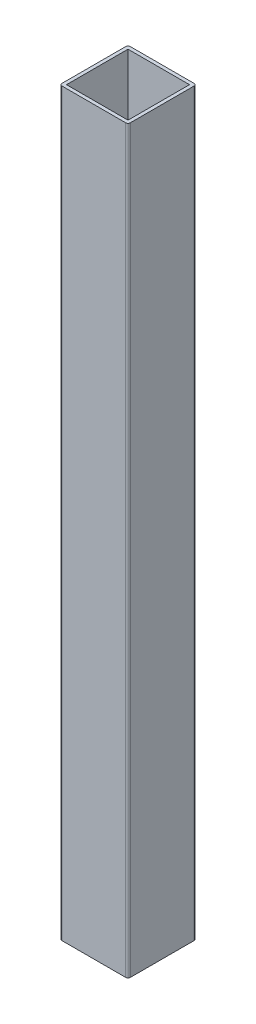
ISO-10303-21;
HEADER;
FILE_DESCRIPTION(('STEP AP214'),'2;1');
FILE_NAME('part.step','',(''),(''),'','','');
FILE_SCHEMA(('AUTOMOTIVE_DESIGN { 1 0 10303 214 1 1 1 1 }'));
ENDSEC;
DATA;
#1=APPLICATION_CONTEXT('core data for automotive mechanical design processes');
#2=APPLICATION_PROTOCOL_DEFINITION('international standard','automotive_design',2000,#1);
#3=PRODUCT_CONTEXT('',#1,'mechanical');
#4=PRODUCT('Part','Part','',(#3));
#5=PRODUCT_RELATED_PRODUCT_CATEGORY('part','',(#4));
#6=PRODUCT_DEFINITION_FORMATION('','',#4);
#7=PRODUCT_DEFINITION_CONTEXT('part definition',#1,'design');
#8=PRODUCT_DEFINITION('design','',#6,#7);
#9=PRODUCT_DEFINITION_SHAPE('','',#8);
#10=(LENGTH_UNIT() NAMED_UNIT(*) SI_UNIT(.MILLI.,.METRE.));
#11=(NAMED_UNIT(*) PLANE_ANGLE_UNIT() SI_UNIT($,.RADIAN.));
#12=(NAMED_UNIT(*) SI_UNIT($,.STERADIAN.) SOLID_ANGLE_UNIT());
#13=UNCERTAINTY_MEASURE_WITH_UNIT(LENGTH_MEASURE(1.E-05),#10,'distance_accuracy_value','');
#14=(GEOMETRIC_REPRESENTATION_CONTEXT(3) GLOBAL_UNCERTAINTY_ASSIGNED_CONTEXT((#13)) GLOBAL_UNIT_ASSIGNED_CONTEXT((#10,
#11,#12)) REPRESENTATION_CONTEXT('',''));
#15=CARTESIAN_POINT('',(0.,0.,0.));
#16=DIRECTION('',(0.,0.,1.));
#17=DIRECTION('',(1.,0.,0.));
#18=AXIS2_PLACEMENT_3D('',#15,#16,#17);
#19=CARTESIAN_POINT('',(58.,650.,-58.));
#20=DIRECTION('',(0.,-1.,0.));
#21=DIRECTION('',(0.,0.,-1.));
#22=AXIS2_PLACEMENT_3D('',#19,#20,#21);
#23=PLANE('',#22);
#24=CARTESIAN_POINT('',(58.,650.,-58.));
#25=DIRECTION('',(0.,1.,0.));
#26=DIRECTION('',(0.,0.,-1.));
#27=AXIS2_PLACEMENT_3D('',#24,#25,#26);
#28=CIRCLE('',#27,2.);
#29=CARTESIAN_POINT('',(60.,650.,-58.));
#30=VERTEX_POINT('',#29);
#31=CARTESIAN_POINT('',(58.,650.,-60.));
#32=VERTEX_POINT('',#31);
#33=EDGE_CURVE('E159',#30,#32,#28,.T.);
#34=ORIENTED_EDGE('',*,*,#33,.T.);
#35=DIRECTION('',(-1.,0.,0.));
#36=VECTOR('',#35,1.);
#37=CARTESIAN_POINT('',(2.00000000000001,650.,-60.));
#38=LINE('',#37,#36);
#39=CARTESIAN_POINT('',(2.00000000000001,650.,-60.));
#40=VERTEX_POINT('',#39);
#41=EDGE_CURVE('E162',#32,#40,#38,.T.);
#42=ORIENTED_EDGE('',*,*,#41,.T.);
#43=CARTESIAN_POINT('',(2.,650.,-58.));
#44=DIRECTION('',(0.,1.,0.));
#45=DIRECTION('',(0.,0.,-1.));
#46=AXIS2_PLACEMENT_3D('',#43,#44,#45);
#47=CIRCLE('',#46,2.);
#48=CARTESIAN_POINT('',(0.,650.,-58.));
#49=VERTEX_POINT('',#48);
#50=EDGE_CURVE('E165',#40,#49,#47,.T.);
#51=ORIENTED_EDGE('',*,*,#50,.T.);
#52=DIRECTION('',(0.,0.,1.));
#53=VECTOR('',#52,1.);
#54=CARTESIAN_POINT('',(0.,650.,-2.00000000000001));
#55=LINE('',#54,#53);
#56=CARTESIAN_POINT('',(0.,650.,-2.00000000000001));
#57=VERTEX_POINT('',#56);
#58=EDGE_CURVE('E167',#49,#57,#55,.T.);
#59=ORIENTED_EDGE('',*,*,#58,.T.);
#60=CARTESIAN_POINT('',(2.,650.,-2.));
#61=DIRECTION('',(0.,1.,0.));
#62=DIRECTION('',(0.,0.,-1.));
#63=AXIS2_PLACEMENT_3D('',#60,#61,#62);
#64=CIRCLE('',#63,2.);
#65=CARTESIAN_POINT('',(2.00000000000001,650.,0.));
#66=VERTEX_POINT('',#65);
#67=EDGE_CURVE('E169',#57,#66,#64,.T.);
#68=ORIENTED_EDGE('',*,*,#67,.T.);
#69=DIRECTION('',(1.,0.,0.));
#70=VECTOR('',#69,1.);
#71=CARTESIAN_POINT('',(2.00000000000001,650.,0.));
#72=LINE('',#71,#70);
#73=CARTESIAN_POINT('',(58.,650.,0.));
#74=VERTEX_POINT('',#73);
#75=EDGE_CURVE('E171',#66,#74,#72,.T.);
#76=ORIENTED_EDGE('',*,*,#75,.T.);
#77=CARTESIAN_POINT('',(58.,650.,-2.));
#78=DIRECTION('',(0.,1.,0.));
#79=DIRECTION('',(0.,0.,1.));
#80=AXIS2_PLACEMENT_3D('',#77,#78,#79);
#81=CIRCLE('',#80,2.);
#82=CARTESIAN_POINT('',(60.,650.,-2.));
#83=VERTEX_POINT('',#82);
#84=EDGE_CURVE('E173',#74,#83,#81,.T.);
#85=ORIENTED_EDGE('',*,*,#84,.T.);
#86=DIRECTION('',(0.,0.,-1.));
#87=VECTOR('',#86,1.);
#88=CARTESIAN_POINT('',(60.,650.,-2.));
#89=LINE('',#88,#87);
#90=EDGE_CURVE('E175',#83,#30,#89,.T.);
#91=ORIENTED_EDGE('',*,*,#90,.T.);
#92=EDGE_LOOP('',(#34,#42,#51,#59,#68,#76,#85,#91));
#93=FACE_BOUND('',#92,.T.);
#94=DIRECTION('',(0.,0.,1.));
#95=VECTOR('',#94,1.);
#96=CARTESIAN_POINT('',(3.,650.,-3.));
#97=LINE('',#96,#95);
#98=CARTESIAN_POINT('',(3.,650.,-57.));
#99=VERTEX_POINT('',#98);
#100=CARTESIAN_POINT('',(3.,650.,-3.));
#101=VERTEX_POINT('',#100);
#102=EDGE_CURVE('E123',#99,#101,#97,.T.);
#103=ORIENTED_EDGE('',*,*,#102,.F.);
#104=DIRECTION('',(-1.,0.,0.));
#105=VECTOR('',#104,1.);
#106=CARTESIAN_POINT('',(3.,650.,-57.));
#107=LINE('',#106,#105);
#108=CARTESIAN_POINT('',(57.,650.,-57.));
#109=VERTEX_POINT('',#108);
#110=EDGE_CURVE('E145',#109,#99,#107,.T.);
#111=ORIENTED_EDGE('',*,*,#110,.F.);
#112=DIRECTION('',(0.,0.,-1.));
#113=VECTOR('',#112,1.);
#114=CARTESIAN_POINT('',(57.,650.,-3.));
#115=LINE('',#114,#113);
#116=CARTESIAN_POINT('',(57.,650.,-3.));
#117=VERTEX_POINT('',#116);
#118=EDGE_CURVE('E143',#117,#109,#115,.T.);
#119=ORIENTED_EDGE('',*,*,#118,.F.);
#120=DIRECTION('',(1.,0.,0.));
#121=VECTOR('',#120,1.);
#122=CARTESIAN_POINT('',(3.,650.,-3.));
#123=LINE('',#122,#121);
#124=EDGE_CURVE('E131',#101,#117,#123,.T.);
#125=ORIENTED_EDGE('',*,*,#124,.F.);
#126=EDGE_LOOP('',(#103,#111,#119,#125));
#127=FACE_BOUND('',#126,.T.);
#128=ADVANCED_FACE('F34',(#93,#127),#23,.F.);
#129=CARTESIAN_POINT('',(58.,0.,-58.));
#130=DIRECTION('',(0.,-1.,0.));
#131=DIRECTION('',(0.,0.,-1.));
#132=AXIS2_PLACEMENT_3D('',#129,#130,#131);
#133=PLANE('',#132);
#134=CARTESIAN_POINT('',(58.,0.,-58.));
#135=DIRECTION('',(0.,1.,0.));
#136=DIRECTION('',(0.,0.,-1.));
#137=AXIS2_PLACEMENT_3D('',#134,#135,#136);
#138=CIRCLE('',#137,2.);
#139=CARTESIAN_POINT('',(60.,0.,-58.));
#140=VERTEX_POINT('',#139);
#141=CARTESIAN_POINT('',(58.,0.,-60.));
#142=VERTEX_POINT('',#141);
#143=EDGE_CURVE('E139',#140,#142,#138,.T.);
#144=ORIENTED_EDGE('',*,*,#143,.F.);
#145=DIRECTION('',(0.,0.,-1.));
#146=VECTOR('',#145,1.);
#147=CARTESIAN_POINT('',(60.,0.,-2.));
#148=LINE('',#147,#146);
#149=CARTESIAN_POINT('',(60.,0.,-2.));
#150=VERTEX_POINT('',#149);
#151=EDGE_CURVE('E163',#150,#140,#148,.T.);
#152=ORIENTED_EDGE('',*,*,#151,.F.);
#153=CARTESIAN_POINT('',(58.,0.,-2.));
#154=DIRECTION('',(0.,1.,0.));
#155=DIRECTION('',(0.,0.,1.));
#156=AXIS2_PLACEMENT_3D('',#153,#154,#155);
#157=CIRCLE('',#156,2.);
#158=CARTESIAN_POINT('',(58.,0.,0.));
#159=VERTEX_POINT('',#158);
#160=EDGE_CURVE('E190',#159,#150,#157,.T.);
#161=ORIENTED_EDGE('',*,*,#160,.F.);
#162=DIRECTION('',(1.,0.,0.));
#163=VECTOR('',#162,1.);
#164=CARTESIAN_POINT('',(2.00000000000001,0.,0.));
#165=LINE('',#164,#163);
#166=CARTESIAN_POINT('',(2.00000000000001,0.,0.));
#167=VERTEX_POINT('',#166);
#168=EDGE_CURVE('E188',#167,#159,#165,.T.);
#169=ORIENTED_EDGE('',*,*,#168,.F.);
#170=CARTESIAN_POINT('',(2.,0.,-2.));
#171=DIRECTION('',(0.,1.,0.));
#172=DIRECTION('',(0.,0.,-1.));
#173=AXIS2_PLACEMENT_3D('',#170,#171,#172);
#174=CIRCLE('',#173,2.);
#175=CARTESIAN_POINT('',(0.,0.,-2.00000000000001));
#176=VERTEX_POINT('',#175);
#177=EDGE_CURVE('E186',#176,#167,#174,.T.);
#178=ORIENTED_EDGE('',*,*,#177,.F.);
#179=DIRECTION('',(0.,0.,1.));
#180=VECTOR('',#179,1.);
#181=CARTESIAN_POINT('',(0.,0.,-2.00000000000001));
#182=LINE('',#181,#180);
#183=CARTESIAN_POINT('',(0.,0.,-58.));
#184=VERTEX_POINT('',#183);
#185=EDGE_CURVE('E184',#184,#176,#182,.T.);
#186=ORIENTED_EDGE('',*,*,#185,.F.);
#187=CARTESIAN_POINT('',(2.,0.,-58.));
#188=DIRECTION('',(0.,1.,0.));
#189=DIRECTION('',(0.,0.,-1.));
#190=AXIS2_PLACEMENT_3D('',#187,#188,#189);
#191=CIRCLE('',#190,2.);
#192=CARTESIAN_POINT('',(2.00000000000001,0.,-60.));
#193=VERTEX_POINT('',#192);
#194=EDGE_CURVE('E182',#193,#184,#191,.T.);
#195=ORIENTED_EDGE('',*,*,#194,.F.);
#196=DIRECTION('',(-1.,0.,0.));
#197=VECTOR('',#196,1.);
#198=CARTESIAN_POINT('',(2.00000000000001,0.,-60.));
#199=LINE('',#198,#197);
#200=EDGE_CURVE('E180',#142,#193,#199,.T.);
#201=ORIENTED_EDGE('',*,*,#200,.F.);
#202=EDGE_LOOP('',(#144,#152,#161,#169,#178,#186,#195,#201));
#203=FACE_BOUND('',#202,.T.);
#204=DIRECTION('',(-1.,0.,0.));
#205=VECTOR('',#204,1.);
#206=CARTESIAN_POINT('',(3.,0.,-57.));
#207=LINE('',#206,#205);
#208=CARTESIAN_POINT('',(57.,0.,-57.));
#209=VERTEX_POINT('',#208);
#210=CARTESIAN_POINT('',(3.,0.,-57.));
#211=VERTEX_POINT('',#210);
#212=EDGE_CURVE('E132',#209,#211,#207,.T.);
#213=ORIENTED_EDGE('',*,*,#212,.T.);
#214=DIRECTION('',(0.,0.,1.));
#215=VECTOR('',#214,1.);
#216=CARTESIAN_POINT('',(3.,0.,-3.));
#217=LINE('',#216,#215);
#218=CARTESIAN_POINT('',(3.,0.,-3.));
#219=VERTEX_POINT('',#218);
#220=EDGE_CURVE('E57',#211,#219,#217,.T.);
#221=ORIENTED_EDGE('',*,*,#220,.T.);
#222=DIRECTION('',(1.,0.,0.));
#223=VECTOR('',#222,1.);
#224=CARTESIAN_POINT('',(3.,0.,-3.));
#225=LINE('',#224,#223);
#226=CARTESIAN_POINT('',(57.,0.,-3.));
#227=VERTEX_POINT('',#226);
#228=EDGE_CURVE('E138',#219,#227,#225,.T.);
#229=ORIENTED_EDGE('',*,*,#228,.T.);
#230=DIRECTION('',(0.,0.,-1.));
#231=VECTOR('',#230,1.);
#232=CARTESIAN_POINT('',(57.,0.,-3.));
#233=LINE('',#232,#231);
#234=EDGE_CURVE('E151',#227,#209,#233,.T.);
#235=ORIENTED_EDGE('',*,*,#234,.T.);
#236=EDGE_LOOP('',(#213,#221,#229,#235));
#237=FACE_BOUND('',#236,.T.);
#238=ADVANCED_FACE('F220',(#203,#237),#133,.T.);
#239=CARTESIAN_POINT('',(58.,650.,-58.));
#240=DIRECTION('',(0.,-1.,0.));
#241=DIRECTION('',(0.,0.,-1.));
#242=AXIS2_PLACEMENT_3D('',#239,#240,#241);
#243=CYLINDRICAL_SURFACE('',#242,2.);
#244=ORIENTED_EDGE('',*,*,#143,.T.);
#245=DIRECTION('',(0.,-1.,0.));
#246=VECTOR('',#245,1.);
#247=CARTESIAN_POINT('',(58.,650.,-60.));
#248=LINE('',#247,#246);
#249=EDGE_CURVE('E11',#32,#142,#248,.T.);
#250=ORIENTED_EDGE('',*,*,#249,.F.);
#251=ORIENTED_EDGE('',*,*,#33,.F.);
#252=DIRECTION('',(0.,-1.,0.));
#253=VECTOR('',#252,1.);
#254=CARTESIAN_POINT('',(60.,650.,-58.));
#255=LINE('',#254,#253);
#256=EDGE_CURVE('E177',#30,#140,#255,.T.);
#257=ORIENTED_EDGE('',*,*,#256,.T.);
#258=EDGE_LOOP('',(#244,#250,#251,#257));
#259=FACE_BOUND('',#258,.T.);
#260=ADVANCED_FACE('F36',(#259),#243,.T.);
#261=CARTESIAN_POINT('',(2.00000000000001,650.,-60.));
#262=DIRECTION('',(0.,0.,1.));
#263=DIRECTION('',(1.,0.,0.));
#264=AXIS2_PLACEMENT_3D('',#261,#262,#263);
#265=PLANE('',#264);
#266=ORIENTED_EDGE('',*,*,#200,.T.);
#267=DIRECTION('',(0.,-1.,0.));
#268=VECTOR('',#267,1.);
#269=CARTESIAN_POINT('',(2.00000000000001,650.,-60.));
#270=LINE('',#269,#268);
#271=EDGE_CURVE('E42',#40,#193,#270,.T.);
#272=ORIENTED_EDGE('',*,*,#271,.F.);
#273=ORIENTED_EDGE('',*,*,#41,.F.);
#274=ORIENTED_EDGE('',*,*,#249,.T.);
#275=EDGE_LOOP('',(#266,#272,#273,#274));
#276=FACE_BOUND('',#275,.T.);
#277=ADVANCED_FACE('F237',(#276),#265,.F.);
#278=CARTESIAN_POINT('',(2.,650.,-58.));
#279=DIRECTION('',(0.,-1.,0.));
#280=DIRECTION('',(0.,0.,-1.));
#281=AXIS2_PLACEMENT_3D('',#278,#279,#280);
#282=CYLINDRICAL_SURFACE('',#281,2.);
#283=ORIENTED_EDGE('',*,*,#194,.T.);
#284=DIRECTION('',(0.,-1.,0.));
#285=VECTOR('',#284,1.);
#286=CARTESIAN_POINT('',(0.,650.,-58.));
#287=LINE('',#286,#285);
#288=EDGE_CURVE('E207',#49,#184,#287,.T.);
#289=ORIENTED_EDGE('',*,*,#288,.F.);
#290=ORIENTED_EDGE('',*,*,#50,.F.);
#291=ORIENTED_EDGE('',*,*,#271,.T.);
#292=EDGE_LOOP('',(#283,#289,#290,#291));
#293=FACE_BOUND('',#292,.T.);
#294=ADVANCED_FACE('F214',(#293),#282,.T.);
#295=CARTESIAN_POINT('',(0.,650.,-2.00000000000001));
#296=DIRECTION('',(1.,0.,0.));
#297=DIRECTION('',(0.,0.,-1.));
#298=AXIS2_PLACEMENT_3D('',#295,#296,#297);
#299=PLANE('',#298);
#300=ORIENTED_EDGE('',*,*,#185,.T.);
#301=DIRECTION('',(0.,-1.,0.));
#302=VECTOR('',#301,1.);
#303=CARTESIAN_POINT('',(0.,650.,-2.00000000000001));
#304=LINE('',#303,#302);
#305=EDGE_CURVE('E204',#57,#176,#304,.T.);
#306=ORIENTED_EDGE('',*,*,#305,.F.);
#307=ORIENTED_EDGE('',*,*,#58,.F.);
#308=ORIENTED_EDGE('',*,*,#288,.T.);
#309=EDGE_LOOP('',(#300,#306,#307,#308));
#310=FACE_BOUND('',#309,.T.);
#311=ADVANCED_FACE('F226',(#310),#299,.F.);
#312=CARTESIAN_POINT('',(2.,650.,-2.));
#313=DIRECTION('',(0.,-1.,0.));
#314=DIRECTION('',(0.,0.,-1.));
#315=AXIS2_PLACEMENT_3D('',#312,#313,#314);
#316=CYLINDRICAL_SURFACE('',#315,2.);
#317=ORIENTED_EDGE('',*,*,#177,.T.);
#318=DIRECTION('',(0.,-1.,0.));
#319=VECTOR('',#318,1.);
#320=CARTESIAN_POINT('',(2.00000000000001,650.,0.));
#321=LINE('',#320,#319);
#322=EDGE_CURVE('E201',#66,#167,#321,.T.);
#323=ORIENTED_EDGE('',*,*,#322,.F.);
#324=ORIENTED_EDGE('',*,*,#67,.F.);
#325=ORIENTED_EDGE('',*,*,#305,.T.);
#326=EDGE_LOOP('',(#317,#323,#324,#325));
#327=FACE_BOUND('',#326,.T.);
#328=ADVANCED_FACE('F230',(#327),#316,.T.);
#329=CARTESIAN_POINT('',(2.00000000000001,650.,0.));
#330=DIRECTION('',(0.,0.,-1.));
#331=DIRECTION('',(-1.,0.,0.));
#332=AXIS2_PLACEMENT_3D('',#329,#330,#331);
#333=PLANE('',#332);
#334=ORIENTED_EDGE('',*,*,#168,.T.);
#335=DIRECTION('',(0.,-1.,0.));
#336=VECTOR('',#335,1.);
#337=CARTESIAN_POINT('',(58.,650.,0.));
#338=LINE('',#337,#336);
#339=EDGE_CURVE('E198',#74,#159,#338,.T.);
#340=ORIENTED_EDGE('',*,*,#339,.F.);
#341=ORIENTED_EDGE('',*,*,#75,.F.);
#342=ORIENTED_EDGE('',*,*,#322,.T.);
#343=EDGE_LOOP('',(#334,#340,#341,#342));
#344=FACE_BOUND('',#343,.T.);
#345=ADVANCED_FACE('F250',(#344),#333,.F.);
#346=CARTESIAN_POINT('',(58.,650.,-2.));
#347=DIRECTION('',(0.,-1.,0.));
#348=DIRECTION('',(0.,0.,-1.));
#349=AXIS2_PLACEMENT_3D('',#346,#347,#348);
#350=CYLINDRICAL_SURFACE('',#349,2.);
#351=ORIENTED_EDGE('',*,*,#160,.T.);
#352=DIRECTION('',(0.,-1.,0.));
#353=VECTOR('',#352,1.);
#354=CARTESIAN_POINT('',(60.,650.,-2.));
#355=LINE('',#354,#353);
#356=EDGE_CURVE('E195',#83,#150,#355,.T.);
#357=ORIENTED_EDGE('',*,*,#356,.F.);
#358=ORIENTED_EDGE('',*,*,#84,.F.);
#359=ORIENTED_EDGE('',*,*,#339,.T.);
#360=EDGE_LOOP('',(#351,#357,#358,#359));
#361=FACE_BOUND('',#360,.T.);
#362=ADVANCED_FACE('F248',(#361),#350,.T.);
#363=CARTESIAN_POINT('',(60.,650.,-2.));
#364=DIRECTION('',(-1.,0.,0.));
#365=DIRECTION('',(0.,0.,1.));
#366=AXIS2_PLACEMENT_3D('',#363,#364,#365);
#367=PLANE('',#366);
#368=ORIENTED_EDGE('',*,*,#151,.T.);
#369=ORIENTED_EDGE('',*,*,#256,.F.);
#370=ORIENTED_EDGE('',*,*,#90,.F.);
#371=ORIENTED_EDGE('',*,*,#356,.T.);
#372=EDGE_LOOP('',(#368,#369,#370,#371));
#373=FACE_BOUND('',#372,.T.);
#374=ADVANCED_FACE('F243',(#373),#367,.F.);
#375=CARTESIAN_POINT('',(3.,650.,-3.));
#376=DIRECTION('',(1.,0.,0.));
#377=DIRECTION('',(0.,0.,-1.));
#378=AXIS2_PLACEMENT_3D('',#375,#376,#377);
#379=PLANE('',#378);
#380=ORIENTED_EDGE('',*,*,#220,.F.);
#381=DIRECTION('',(0.,-1.,0.));
#382=VECTOR('',#381,1.);
#383=CARTESIAN_POINT('',(3.,650.,-57.));
#384=LINE('',#383,#382);
#385=EDGE_CURVE('E127',#99,#211,#384,.T.);
#386=ORIENTED_EDGE('',*,*,#385,.F.);
#387=ORIENTED_EDGE('',*,*,#102,.T.);
#388=DIRECTION('',(0.,-1.,0.));
#389=VECTOR('',#388,1.);
#390=CARTESIAN_POINT('',(3.,650.,-3.));
#391=LINE('',#390,#389);
#392=EDGE_CURVE('E126',#101,#219,#391,.T.);
#393=ORIENTED_EDGE('',*,*,#392,.T.);
#394=EDGE_LOOP('',(#380,#386,#387,#393));
#395=FACE_BOUND('',#394,.T.);
#396=ADVANCED_FACE('F125',(#395),#379,.T.);
#397=CARTESIAN_POINT('',(3.,650.,-3.));
#398=DIRECTION('',(0.,0.,-1.));
#399=DIRECTION('',(-1.,0.,0.));
#400=AXIS2_PLACEMENT_3D('',#397,#398,#399);
#401=PLANE('',#400);
#402=ORIENTED_EDGE('',*,*,#228,.F.);
#403=ORIENTED_EDGE('',*,*,#392,.F.);
#404=ORIENTED_EDGE('',*,*,#124,.T.);
#405=DIRECTION('',(0.,-1.,0.));
#406=VECTOR('',#405,1.);
#407=CARTESIAN_POINT('',(57.,650.,-3.));
#408=LINE('',#407,#406);
#409=EDGE_CURVE('E140',#117,#227,#408,.T.);
#410=ORIENTED_EDGE('',*,*,#409,.T.);
#411=EDGE_LOOP('',(#402,#403,#404,#410));
#412=FACE_BOUND('',#411,.T.);
#413=ADVANCED_FACE('F135',(#412),#401,.T.);
#414=CARTESIAN_POINT('',(57.,650.,-3.));
#415=DIRECTION('',(-1.,0.,0.));
#416=DIRECTION('',(0.,0.,1.));
#417=AXIS2_PLACEMENT_3D('',#414,#415,#416);
#418=PLANE('',#417);
#419=ORIENTED_EDGE('',*,*,#234,.F.);
#420=ORIENTED_EDGE('',*,*,#409,.F.);
#421=ORIENTED_EDGE('',*,*,#118,.T.);
#422=DIRECTION('',(0.,-1.,0.));
#423=VECTOR('',#422,1.);
#424=CARTESIAN_POINT('',(57.,650.,-57.));
#425=LINE('',#424,#423);
#426=EDGE_CURVE('E49',#109,#209,#425,.T.);
#427=ORIENTED_EDGE('',*,*,#426,.T.);
#428=EDGE_LOOP('',(#419,#420,#421,#427));
#429=FACE_BOUND('',#428,.T.);
#430=ADVANCED_FACE('F275',(#429),#418,.T.);
#431=CARTESIAN_POINT('',(3.,650.,-57.));
#432=DIRECTION('',(0.,0.,1.));
#433=DIRECTION('',(1.,0.,0.));
#434=AXIS2_PLACEMENT_3D('',#431,#432,#433);
#435=PLANE('',#434);
#436=ORIENTED_EDGE('',*,*,#212,.F.);
#437=ORIENTED_EDGE('',*,*,#426,.F.);
#438=ORIENTED_EDGE('',*,*,#110,.T.);
#439=ORIENTED_EDGE('',*,*,#385,.T.);
#440=EDGE_LOOP('',(#436,#437,#438,#439));
#441=FACE_BOUND('',#440,.T.);
#442=ADVANCED_FACE('F279',(#441),#435,.T.);
#443=CLOSED_SHELL('',(#128,#238,#260,#277,#294,#311,#328,#345,#362,#374,#396,#413,#430,#442));
#444=MANIFOLD_SOLID_BREP('B2',#443);
#445=ADVANCED_BREP_SHAPE_REPRESENTATION('',(#18,#444),#14);
#446=SHAPE_DEFINITION_REPRESENTATION(#9,#445);
ENDSEC;
END-ISO-10303-21;
